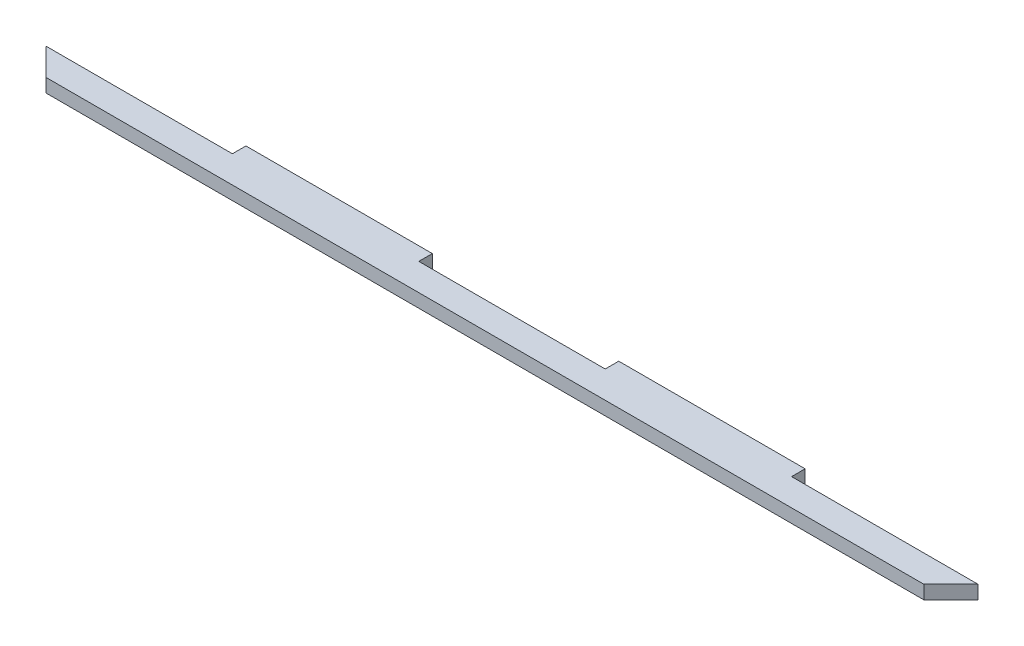
ISO-10303-21;
HEADER;
FILE_DESCRIPTION(('STEP AP214'),'2;1');
FILE_NAME('part.step','',(''),(''),'','','');
FILE_SCHEMA(('AUTOMOTIVE_DESIGN { 1 0 10303 214 1 1 1 1 }'));
ENDSEC;
DATA;
#1=APPLICATION_CONTEXT('core data for automotive mechanical design processes');
#2=APPLICATION_PROTOCOL_DEFINITION('international standard','automotive_design',2000,#1);
#3=PRODUCT_CONTEXT('',#1,'mechanical');
#4=PRODUCT('Part','Part','',(#3));
#5=PRODUCT_RELATED_PRODUCT_CATEGORY('part','',(#4));
#6=PRODUCT_DEFINITION_FORMATION('','',#4);
#7=PRODUCT_DEFINITION_CONTEXT('part definition',#1,'design');
#8=PRODUCT_DEFINITION('design','',#6,#7);
#9=PRODUCT_DEFINITION_SHAPE('','',#8);
#10=(LENGTH_UNIT() NAMED_UNIT(*) SI_UNIT(.MILLI.,.METRE.));
#11=(NAMED_UNIT(*) PLANE_ANGLE_UNIT() SI_UNIT($,.RADIAN.));
#12=(NAMED_UNIT(*) SI_UNIT($,.STERADIAN.) SOLID_ANGLE_UNIT());
#13=UNCERTAINTY_MEASURE_WITH_UNIT(LENGTH_MEASURE(1.E-05),#10,'distance_accuracy_value','');
#14=(GEOMETRIC_REPRESENTATION_CONTEXT(3) GLOBAL_UNCERTAINTY_ASSIGNED_CONTEXT((#13)) GLOBAL_UNIT_ASSIGNED_CONTEXT((#10,
#11,#12)) REPRESENTATION_CONTEXT('',''));
#15=CARTESIAN_POINT('',(0.,0.,0.));
#16=DIRECTION('',(0.,0.,1.));
#17=DIRECTION('',(1.,0.,0.));
#18=AXIS2_PLACEMENT_3D('',#15,#16,#17);
#19=CARTESIAN_POINT('',(-61.95,3.,-4.5));
#20=DIRECTION('',(1.,0.,0.));
#21=DIRECTION('',(0.,0.,-1.));
#22=AXIS2_PLACEMENT_3D('',#19,#20,#21);
#23=PLANE('',#22);
#24=DIRECTION('',(0.,0.,1.));
#25=VECTOR('',#24,1.);
#26=CARTESIAN_POINT('',(-61.95,0.,-4.5));
#27=LINE('',#26,#25);
#28=CARTESIAN_POINT('',(-61.95,0.,-4.5));
#29=VERTEX_POINT('',#28);
#30=CARTESIAN_POINT('',(-61.95,0.,-1.5));
#31=VERTEX_POINT('',#30);
#32=EDGE_CURVE('E152',#29,#31,#27,.T.);
#33=ORIENTED_EDGE('',*,*,#32,.T.);
#34=DIRECTION('',(0.,-1.,0.));
#35=VECTOR('',#34,1.);
#36=CARTESIAN_POINT('',(-61.95,3.,-1.5));
#37=LINE('',#36,#35);
#38=CARTESIAN_POINT('',(-61.95,3.,-1.5));
#39=VERTEX_POINT('',#38);
#40=EDGE_CURVE('E11',#39,#31,#37,.T.);
#41=ORIENTED_EDGE('',*,*,#40,.F.);
#42=DIRECTION('',(0.,0.,1.));
#43=VECTOR('',#42,1.);
#44=CARTESIAN_POINT('',(-61.95,3.,-4.5));
#45=LINE('',#44,#43);
#46=CARTESIAN_POINT('',(-61.95,3.,-4.5));
#47=VERTEX_POINT('',#46);
#48=EDGE_CURVE('E174',#47,#39,#45,.T.);
#49=ORIENTED_EDGE('',*,*,#48,.F.);
#50=DIRECTION('',(0.,-1.,0.));
#51=VECTOR('',#50,1.);
#52=CARTESIAN_POINT('',(-61.95,3.,-4.5));
#53=LINE('',#52,#51);
#54=EDGE_CURVE('E148',#47,#29,#53,.T.);
#55=ORIENTED_EDGE('',*,*,#54,.T.);
#56=EDGE_LOOP('',(#33,#41,#49,#55));
#57=FACE_BOUND('',#56,.T.);
#58=ADVANCED_FACE('F32',(#57),#23,.F.);
#59=CARTESIAN_POINT('',(-103.25,3.,-1.5));
#60=DIRECTION('',(0.,0.,1.));
#61=DIRECTION('',(1.,0.,0.));
#62=AXIS2_PLACEMENT_3D('',#59,#60,#61);
#63=PLANE('',#62);
#64=DIRECTION('',(-1.,0.,0.));
#65=VECTOR('',#64,1.);
#66=CARTESIAN_POINT('',(-103.25,0.,-1.5));
#67=LINE('',#66,#65);
#68=CARTESIAN_POINT('',(-103.25,0.,-1.5));
#69=VERTEX_POINT('',#68);
#70=EDGE_CURVE('E155',#31,#69,#67,.T.);
#71=ORIENTED_EDGE('',*,*,#70,.T.);
#72=DIRECTION('',(0.,-1.,0.));
#73=VECTOR('',#72,1.);
#74=CARTESIAN_POINT('',(-103.25,3.,-1.5));
#75=LINE('',#74,#73);
#76=CARTESIAN_POINT('',(-103.25,3.,-1.5));
#77=VERTEX_POINT('',#76);
#78=EDGE_CURVE('E40',#77,#69,#75,.T.);
#79=ORIENTED_EDGE('',*,*,#78,.F.);
#80=DIRECTION('',(-1.,0.,0.));
#81=VECTOR('',#80,1.);
#82=CARTESIAN_POINT('',(-103.25,3.,-1.5));
#83=LINE('',#82,#81);
#84=EDGE_CURVE('E103',#39,#77,#83,.T.);
#85=ORIENTED_EDGE('',*,*,#84,.F.);
#86=ORIENTED_EDGE('',*,*,#40,.T.);
#87=EDGE_LOOP('',(#71,#79,#85,#86));
#88=FACE_BOUND('',#87,.T.);
#89=ADVANCED_FACE('F252',(#88),#63,.F.);
#90=CARTESIAN_POINT('',(-103.25,3.,-1.5));
#91=DIRECTION('',(0.707106781186539,0.,-0.707106781186556));
#92=DIRECTION('',(-0.707106781186556,0.,-0.707106781186539));
#93=AXIS2_PLACEMENT_3D('',#90,#91,#92);
#94=PLANE('',#93);
#95=DIRECTION('',(0.707106781186556,0.,0.707106781186539));
#96=VECTOR('',#95,1.);
#97=CARTESIAN_POINT('',(-103.25,0.,-1.5));
#98=LINE('',#97,#96);
#99=CARTESIAN_POINT('',(-97.2499999999998,0.,4.5));
#100=VERTEX_POINT('',#99);
#101=EDGE_CURVE('E157',#69,#100,#98,.T.);
#102=ORIENTED_EDGE('',*,*,#101,.T.);
#103=DIRECTION('',(0.,-1.,0.));
#104=VECTOR('',#103,1.);
#105=CARTESIAN_POINT('',(-97.2499999999998,3.,4.5));
#106=LINE('',#105,#104);
#107=CARTESIAN_POINT('',(-97.2499999999998,3.,4.5));
#108=VERTEX_POINT('',#107);
#109=EDGE_CURVE('E193',#108,#100,#106,.T.);
#110=ORIENTED_EDGE('',*,*,#109,.F.);
#111=DIRECTION('',(0.707106781186556,0.,0.707106781186539));
#112=VECTOR('',#111,1.);
#113=CARTESIAN_POINT('',(-103.25,3.,-1.5));
#114=LINE('',#113,#112);
#115=EDGE_CURVE('E201',#77,#108,#114,.T.);
#116=ORIENTED_EDGE('',*,*,#115,.F.);
#117=ORIENTED_EDGE('',*,*,#78,.T.);
#118=EDGE_LOOP('',(#102,#110,#116,#117));
#119=FACE_BOUND('',#118,.T.);
#120=ADVANCED_FACE('F199',(#119),#94,.F.);
#121=CARTESIAN_POINT('',(-97.2499999999998,3.,4.5));
#122=DIRECTION('',(0.,0.,-1.));
#123=DIRECTION('',(-1.,0.,0.));
#124=AXIS2_PLACEMENT_3D('',#121,#122,#123);
#125=PLANE('',#124);
#126=DIRECTION('',(1.,0.,0.));
#127=VECTOR('',#126,1.);
#128=CARTESIAN_POINT('',(-97.2499999999998,0.,4.5));
#129=LINE('',#128,#127);
#130=CARTESIAN_POINT('',(97.2500000000001,0.,4.50000000000001));
#131=VERTEX_POINT('',#130);
#132=EDGE_CURVE('E159',#100,#131,#129,.T.);
#133=ORIENTED_EDGE('',*,*,#132,.T.);
#134=DIRECTION('',(0.,-1.,0.));
#135=VECTOR('',#134,1.);
#136=CARTESIAN_POINT('',(97.2500000000001,3.,4.50000000000001));
#137=LINE('',#136,#135);
#138=CARTESIAN_POINT('',(97.2500000000001,3.,4.50000000000001));
#139=VERTEX_POINT('',#138);
#140=EDGE_CURVE('E190',#139,#131,#137,.T.);
#141=ORIENTED_EDGE('',*,*,#140,.F.);
#142=DIRECTION('',(1.,0.,0.));
#143=VECTOR('',#142,1.);
#144=CARTESIAN_POINT('',(-97.2499999999998,3.,4.5));
#145=LINE('',#144,#143);
#146=EDGE_CURVE('E219',#108,#139,#145,.T.);
#147=ORIENTED_EDGE('',*,*,#146,.F.);
#148=ORIENTED_EDGE('',*,*,#109,.T.);
#149=EDGE_LOOP('',(#133,#141,#147,#148));
#150=FACE_BOUND('',#149,.T.);
#151=ADVANCED_FACE('F210',(#150),#125,.F.);
#152=CARTESIAN_POINT('',(103.25,3.,-1.5));
#153=DIRECTION('',(-0.707106781186551,0.,-0.707106781186544));
#154=DIRECTION('',(-0.707106781186544,0.,0.707106781186551));
#155=AXIS2_PLACEMENT_3D('',#152,#153,#154);
#156=PLANE('',#155);
#157=DIRECTION('',(0.707106781186544,0.,-0.707106781186551));
#158=VECTOR('',#157,1.);
#159=CARTESIAN_POINT('',(103.25,0.,-1.5));
#160=LINE('',#159,#158);
#161=CARTESIAN_POINT('',(103.25,0.,-1.5));
#162=VERTEX_POINT('',#161);
#163=EDGE_CURVE('E161',#131,#162,#160,.T.);
#164=ORIENTED_EDGE('',*,*,#163,.T.);
#165=DIRECTION('',(0.,-1.,0.));
#166=VECTOR('',#165,1.);
#167=CARTESIAN_POINT('',(103.25,3.,-1.5));
#168=LINE('',#167,#166);
#169=CARTESIAN_POINT('',(103.25,3.,-1.5));
#170=VERTEX_POINT('',#169);
#171=EDGE_CURVE('E187',#170,#162,#168,.T.);
#172=ORIENTED_EDGE('',*,*,#171,.F.);
#173=DIRECTION('',(0.707106781186544,0.,-0.707106781186551));
#174=VECTOR('',#173,1.);
#175=CARTESIAN_POINT('',(103.25,3.,-1.5));
#176=LINE('',#175,#174);
#177=EDGE_CURVE('E216',#139,#170,#176,.T.);
#178=ORIENTED_EDGE('',*,*,#177,.F.);
#179=ORIENTED_EDGE('',*,*,#140,.T.);
#180=EDGE_LOOP('',(#164,#172,#178,#179));
#181=FACE_BOUND('',#180,.T.);
#182=ADVANCED_FACE('F214',(#181),#156,.F.);
#183=CARTESIAN_POINT('',(61.9499999999999,3.,-1.5));
#184=DIRECTION('',(0.,0.,1.));
#185=DIRECTION('',(1.,0.,0.));
#186=AXIS2_PLACEMENT_3D('',#183,#184,#185);
#187=PLANE('',#186);
#188=DIRECTION('',(-1.,0.,0.));
#189=VECTOR('',#188,1.);
#190=CARTESIAN_POINT('',(61.9499999999999,0.,-1.5));
#191=LINE('',#190,#189);
#192=CARTESIAN_POINT('',(61.9499999999999,0.,-1.5));
#193=VERTEX_POINT('',#192);
#194=EDGE_CURVE('E163',#162,#193,#191,.T.);
#195=ORIENTED_EDGE('',*,*,#194,.T.);
#196=DIRECTION('',(0.,-1.,0.));
#197=VECTOR('',#196,1.);
#198=CARTESIAN_POINT('',(61.9499999999999,3.,-1.5));
#199=LINE('',#198,#197);
#200=CARTESIAN_POINT('',(61.9499999999999,3.,-1.5));
#201=VERTEX_POINT('',#200);
#202=EDGE_CURVE('E184',#201,#193,#199,.T.);
#203=ORIENTED_EDGE('',*,*,#202,.F.);
#204=DIRECTION('',(-1.,0.,0.));
#205=VECTOR('',#204,1.);
#206=CARTESIAN_POINT('',(61.9499999999999,3.,-1.5));
#207=LINE('',#206,#205);
#208=EDGE_CURVE('E218',#170,#201,#207,.T.);
#209=ORIENTED_EDGE('',*,*,#208,.F.);
#210=ORIENTED_EDGE('',*,*,#171,.T.);
#211=EDGE_LOOP('',(#195,#203,#209,#210));
#212=FACE_BOUND('',#211,.T.);
#213=ADVANCED_FACE('F265',(#212),#187,.F.);
#214=CARTESIAN_POINT('',(61.95,3.,-4.5));
#215=DIRECTION('',(-1.,0.,0.));
#216=DIRECTION('',(0.,0.,1.));
#217=AXIS2_PLACEMENT_3D('',#214,#215,#216);
#218=PLANE('',#217);
#219=DIRECTION('',(0.,0.,-1.));
#220=VECTOR('',#219,1.);
#221=CARTESIAN_POINT('',(61.95,0.,-4.5));
#222=LINE('',#221,#220);
#223=CARTESIAN_POINT('',(61.95,0.,-4.5));
#224=VERTEX_POINT('',#223);
#225=EDGE_CURVE('E165',#193,#224,#222,.T.);
#226=ORIENTED_EDGE('',*,*,#225,.T.);
#227=DIRECTION('',(0.,-1.,0.));
#228=VECTOR('',#227,1.);
#229=CARTESIAN_POINT('',(61.95,3.,-4.5));
#230=LINE('',#229,#228);
#231=CARTESIAN_POINT('',(61.95,3.,-4.5));
#232=VERTEX_POINT('',#231);
#233=EDGE_CURVE('E181',#232,#224,#230,.T.);
#234=ORIENTED_EDGE('',*,*,#233,.F.);
#235=DIRECTION('',(0.,0.,-1.));
#236=VECTOR('',#235,1.);
#237=CARTESIAN_POINT('',(61.95,3.,-4.5));
#238=LINE('',#237,#236);
#239=EDGE_CURVE('E221',#201,#232,#238,.T.);
#240=ORIENTED_EDGE('',*,*,#239,.F.);
#241=ORIENTED_EDGE('',*,*,#202,.T.);
#242=EDGE_LOOP('',(#226,#234,#240,#241));
#243=FACE_BOUND('',#242,.T.);
#244=ADVANCED_FACE('F268',(#243),#218,.F.);
#245=CARTESIAN_POINT('',(20.65,3.,-4.5));
#246=DIRECTION('',(0.,0.,1.));
#247=DIRECTION('',(1.,0.,0.));
#248=AXIS2_PLACEMENT_3D('',#245,#246,#247);
#249=PLANE('',#248);
#250=DIRECTION('',(-1.,0.,0.));
#251=VECTOR('',#250,1.);
#252=CARTESIAN_POINT('',(20.65,0.,-4.5));
#253=LINE('',#252,#251);
#254=CARTESIAN_POINT('',(20.65,0.,-4.5));
#255=VERTEX_POINT('',#254);
#256=EDGE_CURVE('E167',#224,#255,#253,.T.);
#257=ORIENTED_EDGE('',*,*,#256,.T.);
#258=DIRECTION('',(0.,-1.,0.));
#259=VECTOR('',#258,1.);
#260=CARTESIAN_POINT('',(20.65,3.,-4.5));
#261=LINE('',#260,#259);
#262=CARTESIAN_POINT('',(20.65,3.,-4.5));
#263=VERTEX_POINT('',#262);
#264=EDGE_CURVE('E178',#263,#255,#261,.T.);
#265=ORIENTED_EDGE('',*,*,#264,.F.);
#266=DIRECTION('',(-1.,0.,0.));
#267=VECTOR('',#266,1.);
#268=CARTESIAN_POINT('',(20.65,3.,-4.5));
#269=LINE('',#268,#267);
#270=EDGE_CURVE('E227',#232,#263,#269,.T.);
#271=ORIENTED_EDGE('',*,*,#270,.F.);
#272=ORIENTED_EDGE('',*,*,#233,.T.);
#273=EDGE_LOOP('',(#257,#265,#271,#272));
#274=FACE_BOUND('',#273,.T.);
#275=ADVANCED_FACE('F233',(#274),#249,.F.);
#276=CARTESIAN_POINT('',(20.65,3.,-4.5));
#277=DIRECTION('',(1.,0.,0.));
#278=DIRECTION('',(0.,0.,-1.));
#279=AXIS2_PLACEMENT_3D('',#276,#277,#278);
#280=PLANE('',#279);
#281=DIRECTION('',(0.,0.,1.));
#282=VECTOR('',#281,1.);
#283=CARTESIAN_POINT('',(20.65,0.,-4.5));
#284=LINE('',#283,#282);
#285=CARTESIAN_POINT('',(20.65,0.,-1.5));
#286=VERTEX_POINT('',#285);
#287=EDGE_CURVE('E169',#255,#286,#284,.T.);
#288=ORIENTED_EDGE('',*,*,#287,.T.);
#289=DIRECTION('',(0.,-1.,0.));
#290=VECTOR('',#289,1.);
#291=CARTESIAN_POINT('',(20.65,3.,-1.5));
#292=LINE('',#291,#290);
#293=CARTESIAN_POINT('',(20.65,3.,-1.5));
#294=VERTEX_POINT('',#293);
#295=EDGE_CURVE('E143',#294,#286,#292,.T.);
#296=ORIENTED_EDGE('',*,*,#295,.F.);
#297=DIRECTION('',(0.,0.,1.));
#298=VECTOR('',#297,1.);
#299=CARTESIAN_POINT('',(20.65,3.,-4.5));
#300=LINE('',#299,#298);
#301=EDGE_CURVE('E134',#263,#294,#300,.T.);
#302=ORIENTED_EDGE('',*,*,#301,.F.);
#303=ORIENTED_EDGE('',*,*,#264,.T.);
#304=EDGE_LOOP('',(#288,#296,#302,#303));
#305=FACE_BOUND('',#304,.T.);
#306=ADVANCED_FACE('F237',(#305),#280,.F.);
#307=CARTESIAN_POINT('',(-20.65,3.,-1.5));
#308=DIRECTION('',(0.,0.,1.));
#309=DIRECTION('',(1.,0.,0.));
#310=AXIS2_PLACEMENT_3D('',#307,#308,#309);
#311=PLANE('',#310);
#312=DIRECTION('',(-1.,0.,0.));
#313=VECTOR('',#312,1.);
#314=CARTESIAN_POINT('',(-20.65,0.,-1.5));
#315=LINE('',#314,#313);
#316=CARTESIAN_POINT('',(-20.65,0.,-1.5));
#317=VERTEX_POINT('',#316);
#318=EDGE_CURVE('E142',#286,#317,#315,.T.);
#319=ORIENTED_EDGE('',*,*,#318,.T.);
#320=DIRECTION('',(0.,-1.,0.));
#321=VECTOR('',#320,1.);
#322=CARTESIAN_POINT('',(-20.65,3.,-1.5));
#323=LINE('',#322,#321);
#324=CARTESIAN_POINT('',(-20.65,3.,-1.5));
#325=VERTEX_POINT('',#324);
#326=EDGE_CURVE('E139',#325,#317,#323,.T.);
#327=ORIENTED_EDGE('',*,*,#326,.F.);
#328=DIRECTION('',(-1.,0.,0.));
#329=VECTOR('',#328,1.);
#330=CARTESIAN_POINT('',(-20.65,3.,-1.5));
#331=LINE('',#330,#329);
#332=EDGE_CURVE('E128',#294,#325,#331,.T.);
#333=ORIENTED_EDGE('',*,*,#332,.F.);
#334=ORIENTED_EDGE('',*,*,#295,.T.);
#335=EDGE_LOOP('',(#319,#327,#333,#334));
#336=FACE_BOUND('',#335,.T.);
#337=ADVANCED_FACE('F140',(#336),#311,.F.);
#338=CARTESIAN_POINT('',(-20.65,3.,-4.5));
#339=DIRECTION('',(-1.,0.,0.));
#340=DIRECTION('',(0.,0.,1.));
#341=AXIS2_PLACEMENT_3D('',#338,#339,#340);
#342=PLANE('',#341);
#343=DIRECTION('',(0.,0.,-1.));
#344=VECTOR('',#343,1.);
#345=CARTESIAN_POINT('',(-20.65,0.,-4.5));
#346=LINE('',#345,#344);
#347=CARTESIAN_POINT('',(-20.65,0.,-4.5));
#348=VERTEX_POINT('',#347);
#349=EDGE_CURVE('E89',#317,#348,#346,.T.);
#350=ORIENTED_EDGE('',*,*,#349,.T.);
#351=DIRECTION('',(0.,-1.,0.));
#352=VECTOR('',#351,1.);
#353=CARTESIAN_POINT('',(-20.65,3.,-4.5));
#354=LINE('',#353,#352);
#355=CARTESIAN_POINT('',(-20.65,3.,-4.5));
#356=VERTEX_POINT('',#355);
#357=EDGE_CURVE('E144',#356,#348,#354,.T.);
#358=ORIENTED_EDGE('',*,*,#357,.F.);
#359=DIRECTION('',(0.,0.,-1.));
#360=VECTOR('',#359,1.);
#361=CARTESIAN_POINT('',(-20.65,3.,-4.5));
#362=LINE('',#361,#360);
#363=EDGE_CURVE('E132',#325,#356,#362,.T.);
#364=ORIENTED_EDGE('',*,*,#363,.F.);
#365=ORIENTED_EDGE('',*,*,#326,.T.);
#366=EDGE_LOOP('',(#350,#358,#364,#365));
#367=FACE_BOUND('',#366,.T.);
#368=ADVANCED_FACE('F146',(#367),#342,.F.);
#369=CARTESIAN_POINT('',(-61.95,3.,-4.5));
#370=DIRECTION('',(0.,0.,1.));
#371=DIRECTION('',(1.,0.,0.));
#372=AXIS2_PLACEMENT_3D('',#369,#370,#371);
#373=PLANE('',#372);
#374=DIRECTION('',(-1.,0.,0.));
#375=VECTOR('',#374,1.);
#376=CARTESIAN_POINT('',(-61.95,0.,-4.5));
#377=LINE('',#376,#375);
#378=EDGE_CURVE('E95',#348,#29,#377,.T.);
#379=ORIENTED_EDGE('',*,*,#378,.T.);
#380=ORIENTED_EDGE('',*,*,#54,.F.);
#381=DIRECTION('',(-1.,0.,0.));
#382=VECTOR('',#381,1.);
#383=CARTESIAN_POINT('',(-61.95,3.,-4.5));
#384=LINE('',#383,#382);
#385=EDGE_CURVE('E48',#356,#47,#384,.T.);
#386=ORIENTED_EDGE('',*,*,#385,.F.);
#387=ORIENTED_EDGE('',*,*,#357,.T.);
#388=EDGE_LOOP('',(#379,#380,#386,#387));
#389=FACE_BOUND('',#388,.T.);
#390=ADVANCED_FACE('F241',(#389),#373,.F.);
#391=CARTESIAN_POINT('',(0.,3.,0.));
#392=DIRECTION('',(0.,1.,0.));
#393=DIRECTION('',(0.,0.,1.));
#394=AXIS2_PLACEMENT_3D('',#391,#392,#393);
#395=PLANE('',#394);
#396=ORIENTED_EDGE('',*,*,#48,.T.);
#397=ORIENTED_EDGE('',*,*,#84,.T.);
#398=ORIENTED_EDGE('',*,*,#115,.T.);
#399=ORIENTED_EDGE('',*,*,#146,.T.);
#400=ORIENTED_EDGE('',*,*,#177,.T.);
#401=ORIENTED_EDGE('',*,*,#208,.T.);
#402=ORIENTED_EDGE('',*,*,#239,.T.);
#403=ORIENTED_EDGE('',*,*,#270,.T.);
#404=ORIENTED_EDGE('',*,*,#301,.T.);
#405=ORIENTED_EDGE('',*,*,#332,.T.);
#406=ORIENTED_EDGE('',*,*,#363,.T.);
#407=ORIENTED_EDGE('',*,*,#385,.T.);
#408=EDGE_LOOP('',(#396,#397,#398,#399,#400,#401,#402,#403,#404,#405,#406,#407));
#409=FACE_BOUND('',#408,.T.);
#410=ADVANCED_FACE('F130',(#409),#395,.T.);
#411=CARTESIAN_POINT('',(0.,0.,0.));
#412=DIRECTION('',(0.,1.,0.));
#413=DIRECTION('',(0.,0.,1.));
#414=AXIS2_PLACEMENT_3D('',#411,#412,#413);
#415=PLANE('',#414);
#416=ORIENTED_EDGE('',*,*,#32,.F.);
#417=ORIENTED_EDGE('',*,*,#378,.F.);
#418=ORIENTED_EDGE('',*,*,#349,.F.);
#419=ORIENTED_EDGE('',*,*,#318,.F.);
#420=ORIENTED_EDGE('',*,*,#287,.F.);
#421=ORIENTED_EDGE('',*,*,#256,.F.);
#422=ORIENTED_EDGE('',*,*,#225,.F.);
#423=ORIENTED_EDGE('',*,*,#194,.F.);
#424=ORIENTED_EDGE('',*,*,#163,.F.);
#425=ORIENTED_EDGE('',*,*,#132,.F.);
#426=ORIENTED_EDGE('',*,*,#101,.F.);
#427=ORIENTED_EDGE('',*,*,#70,.F.);
#428=EDGE_LOOP('',(#416,#417,#418,#419,#420,#421,#422,#423,#424,#425,#426,#427));
#429=FACE_BOUND('',#428,.T.);
#430=ADVANCED_FACE('F205',(#429),#415,.F.);
#431=CLOSED_SHELL('',(#58,#89,#120,#151,#182,#213,#244,#275,#306,#337,#368,#390,#410,#430));
#432=MANIFOLD_SOLID_BREP('B2',#431);
#433=ADVANCED_BREP_SHAPE_REPRESENTATION('',(#18,#432),#14);
#434=SHAPE_DEFINITION_REPRESENTATION(#9,#433);
ENDSEC;
END-ISO-10303-21;
